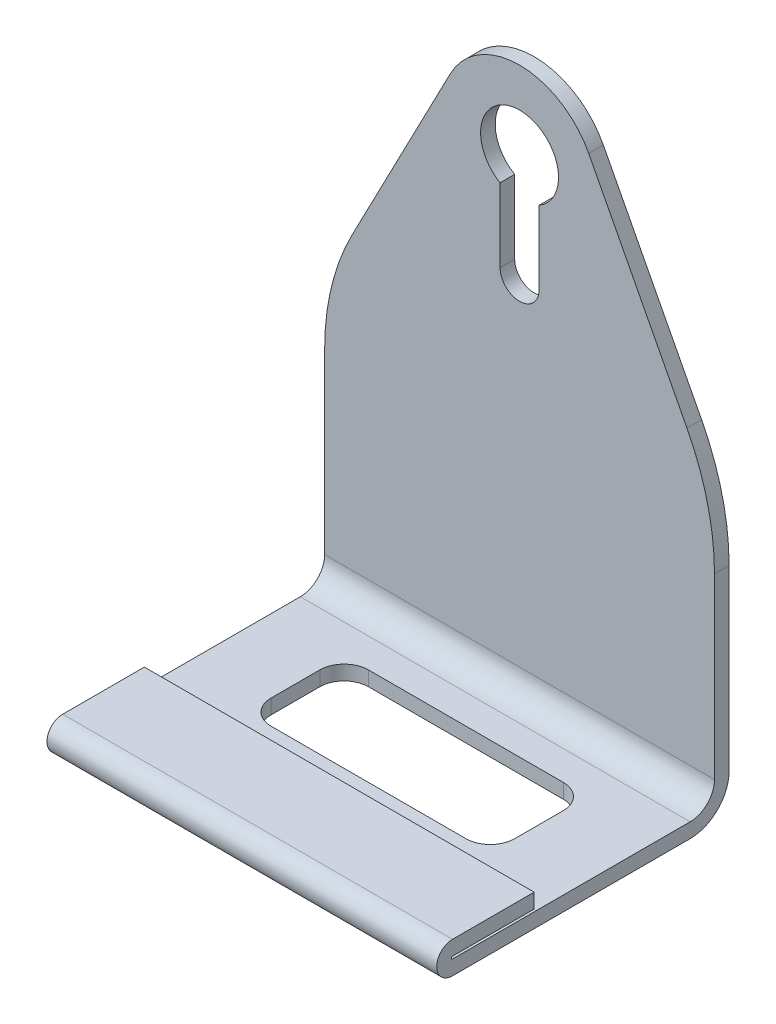
ISO-10303-21;
HEADER;
FILE_DESCRIPTION(('STEP AP214'),'2;1');
FILE_NAME('part.step','',(''),(''),'','','');
FILE_SCHEMA(('AUTOMOTIVE_DESIGN { 1 0 10303 214 1 1 1 1 }'));
ENDSEC;
DATA;
#1=APPLICATION_CONTEXT('core data for automotive mechanical design processes');
#2=APPLICATION_PROTOCOL_DEFINITION('international standard','automotive_design',2000,#1);
#3=PRODUCT_CONTEXT('',#1,'mechanical');
#4=PRODUCT('Part','Part','',(#3));
#5=PRODUCT_RELATED_PRODUCT_CATEGORY('part','',(#4));
#6=PRODUCT_DEFINITION_FORMATION('','',#4);
#7=PRODUCT_DEFINITION_CONTEXT('part definition',#1,'design');
#8=PRODUCT_DEFINITION('design','',#6,#7);
#9=PRODUCT_DEFINITION_SHAPE('','',#8);
#10=(LENGTH_UNIT() NAMED_UNIT(*) SI_UNIT(.MILLI.,.METRE.));
#11=(NAMED_UNIT(*) PLANE_ANGLE_UNIT() SI_UNIT($,.RADIAN.));
#12=(NAMED_UNIT(*) SI_UNIT($,.STERADIAN.) SOLID_ANGLE_UNIT());
#13=UNCERTAINTY_MEASURE_WITH_UNIT(LENGTH_MEASURE(1.E-05),#10,'distance_accuracy_value','');
#14=(GEOMETRIC_REPRESENTATION_CONTEXT(3) GLOBAL_UNCERTAINTY_ASSIGNED_CONTEXT((#13)) GLOBAL_UNIT_ASSIGNED_CONTEXT((#10,
#11,#12)) REPRESENTATION_CONTEXT('',''));
#15=CARTESIAN_POINT('',(0.,0.,0.));
#16=DIRECTION('',(0.,0.,1.));
#17=DIRECTION('',(1.,0.,0.));
#18=AXIS2_PLACEMENT_3D('',#15,#16,#17);
#19=CARTESIAN_POINT('',(40.,115.,3.));
#20=DIRECTION('',(0.,0.,-1.));
#21=DIRECTION('',(0.,1.,0.));
#22=AXIS2_PLACEMENT_3D('',#19,#20,#21);
#23=PLANE('',#22);
#24=DIRECTION('',(0.,1.,0.));
#25=VECTOR('',#24,1.);
#26=CARTESIAN_POINT('',(-4.,115.,3.));
#27=LINE('',#26,#25);
#28=CARTESIAN_POINT('',(-4.,77.,3.));
#29=VERTEX_POINT('',#28);
#30=CARTESIAN_POINT('',(-4.,92.0717967697245,3.));
#31=VERTEX_POINT('',#30);
#32=EDGE_CURVE('E316',#29,#31,#27,.T.);
#33=ORIENTED_EDGE('',*,*,#32,.T.);
#34=CARTESIAN_POINT('',(0.,99.,3.));
#35=DIRECTION('',(0.,0.,-1.));
#36=DIRECTION('',(0.,1.,0.));
#37=AXIS2_PLACEMENT_3D('',#34,#35,#36);
#38=CIRCLE('',#37,8.);
#39=CARTESIAN_POINT('',(4.,92.0717967697245,3.));
#40=VERTEX_POINT('',#39);
#41=EDGE_CURVE('E331',#31,#40,#38,.T.);
#42=ORIENTED_EDGE('',*,*,#41,.T.);
#43=DIRECTION('',(0.,1.,0.));
#44=VECTOR('',#43,1.);
#45=CARTESIAN_POINT('',(4.,115.,3.));
#46=LINE('',#45,#44);
#47=CARTESIAN_POINT('',(4.,77.,3.));
#48=VERTEX_POINT('',#47);
#49=EDGE_CURVE('E329',#48,#40,#46,.T.);
#50=ORIENTED_EDGE('',*,*,#49,.F.);
#51=CARTESIAN_POINT('',(0.,77.,2.99999999999999));
#52=DIRECTION('',(0.,0.,-1.));
#53=DIRECTION('',(0.,1.,0.));
#54=AXIS2_PLACEMENT_3D('',#51,#52,#53);
#55=CIRCLE('',#54,4.);
#56=EDGE_CURVE('E326',#48,#29,#55,.T.);
#57=ORIENTED_EDGE('',*,*,#56,.T.);
#58=EDGE_LOOP('',(#33,#42,#50,#57));
#59=FACE_BOUND('',#58,.T.);
#60=DIRECTION('',(0.,-1.,0.));
#61=VECTOR('',#60,1.);
#62=CARTESIAN_POINT('',(40.,115.,3.));
#63=LINE('',#62,#61);
#64=CARTESIAN_POINT('',(40.,44.5766818829046,2.99999999999999));
#65=VERTEX_POINT('',#64);
#66=CARTESIAN_POINT('',(40.,8.00000000000004,2.99999999999999));
#67=VERTEX_POINT('',#66);
#68=EDGE_CURVE('E353',#65,#67,#63,.T.);
#69=ORIENTED_EDGE('',*,*,#68,.F.);
#70=CARTESIAN_POINT('',(-10.,44.5766818829046,3.));
#71=DIRECTION('',(0.,0.,-1.));
#72=DIRECTION('',(0.,1.,0.));
#73=AXIS2_PLACEMENT_3D('',#70,#71,#72);
#74=CIRCLE('',#73,50.);
#75=CARTESIAN_POINT('',(34.3505416589112,67.6641125446562,2.99999999999999));
#76=VERTEX_POINT('',#75);
#77=EDGE_CURVE('E441',#65,#76,#74,.F.);
#78=ORIENTED_EDGE('',*,*,#77,.T.);
#79=DIRECTION('',(0.461748613235032,-0.887010833178223,0.));
#80=VECTOR('',#79,1.);
#81=CARTESIAN_POINT('',(16.1674282495186,102.593548416789,3.));
#82=LINE('',#81,#80);
#83=CARTESIAN_POINT('',(14.1921733308516,106.387977811761,3.));
#84=VERTEX_POINT('',#83);
#85=EDGE_CURVE('E347',#84,#76,#82,.T.);
#86=ORIENTED_EDGE('',*,*,#85,.F.);
#87=CARTESIAN_POINT('',(0.,99.,3.));
#88=DIRECTION('',(0.,0.,-1.));
#89=DIRECTION('',(0.,1.,0.));
#90=AXIS2_PLACEMENT_3D('',#87,#88,#89);
#91=CIRCLE('',#90,16.);
#92=CARTESIAN_POINT('',(-14.1921733308516,106.387977811761,3.));
#93=VERTEX_POINT('',#92);
#94=EDGE_CURVE('E350',#93,#84,#91,.T.);
#95=ORIENTED_EDGE('',*,*,#94,.F.);
#96=DIRECTION('',(0.461748613235032,0.887010833178223,0.));
#97=VECTOR('',#96,1.);
#98=CARTESIAN_POINT('',(0.88951429643936,135.359630188349,3.));
#99=LINE('',#98,#97);
#100=CARTESIAN_POINT('',(-34.3505416589111,67.6641125446562,2.99999999999999));
#101=VERTEX_POINT('',#100);
#102=EDGE_CURVE('E343',#101,#93,#99,.T.);
#103=ORIENTED_EDGE('',*,*,#102,.F.);
#104=CARTESIAN_POINT('',(10.,44.5766818829046,2.99999999999999));
#105=DIRECTION('',(0.,0.,-1.));
#106=DIRECTION('',(0.,1.,0.));
#107=AXIS2_PLACEMENT_3D('',#104,#105,#106);
#108=CIRCLE('',#107,50.);
#109=CARTESIAN_POINT('',(-40.,44.5766818829046,2.99999999999999));
#110=VERTEX_POINT('',#109);
#111=EDGE_CURVE('E439',#101,#110,#108,.F.);
#112=ORIENTED_EDGE('',*,*,#111,.T.);
#113=DIRECTION('',(0.,-1.,0.));
#114=VECTOR('',#113,1.);
#115=CARTESIAN_POINT('',(-40.,115.,3.));
#116=LINE('',#115,#114);
#117=CARTESIAN_POINT('',(-40.,8.00000000000004,2.99999999999999));
#118=VERTEX_POINT('',#117);
#119=EDGE_CURVE('E352',#110,#118,#116,.T.);
#120=ORIENTED_EDGE('',*,*,#119,.T.);
#121=DIRECTION('',(-1.,0.,0.));
#122=VECTOR('',#121,1.);
#123=CARTESIAN_POINT('',(40.,8.00000000000004,2.99999999999999));
#124=LINE('',#123,#122);
#125=EDGE_CURVE('E425',#67,#118,#124,.T.);
#126=ORIENTED_EDGE('',*,*,#125,.F.);
#127=EDGE_LOOP('',(#69,#78,#86,#95,#103,#112,#120,#126));
#128=FACE_BOUND('',#127,.T.);
#129=ADVANCED_FACE('F43',(#59,#128),#23,.F.);
#130=CARTESIAN_POINT('',(40.,8.00000000000006,0.));
#131=DIRECTION('',(0.,0.,1.));
#132=DIRECTION('',(1.,0.,0.));
#133=AXIS2_PLACEMENT_3D('',#130,#131,#132);
#134=PLANE('',#133);
#135=DIRECTION('',(0.,-1.,0.));
#136=VECTOR('',#135,1.);
#137=CARTESIAN_POINT('',(4.,0.,0.));
#138=LINE('',#137,#136);
#139=CARTESIAN_POINT('',(4.,92.0717967697245,0.));
#140=VERTEX_POINT('',#139);
#141=CARTESIAN_POINT('',(4.,77.,0.));
#142=VERTEX_POINT('',#141);
#143=EDGE_CURVE('E310',#140,#142,#138,.T.);
#144=ORIENTED_EDGE('',*,*,#143,.F.);
#145=CARTESIAN_POINT('',(0.,99.,0.));
#146=DIRECTION('',(0.,0.,1.));
#147=DIRECTION('',(1.,0.,0.));
#148=AXIS2_PLACEMENT_3D('',#145,#146,#147);
#149=CIRCLE('',#148,8.);
#150=CARTESIAN_POINT('',(-4.,92.0717967697245,0.));
#151=VERTEX_POINT('',#150);
#152=EDGE_CURVE('E301',#140,#151,#149,.T.);
#153=ORIENTED_EDGE('',*,*,#152,.T.);
#154=DIRECTION('',(0.,-1.,0.));
#155=VECTOR('',#154,1.);
#156=CARTESIAN_POINT('',(-4.,0.,0.));
#157=LINE('',#156,#155);
#158=CARTESIAN_POINT('',(-4.,77.,0.));
#159=VERTEX_POINT('',#158);
#160=EDGE_CURVE('E304',#151,#159,#157,.T.);
#161=ORIENTED_EDGE('',*,*,#160,.T.);
#162=CARTESIAN_POINT('',(0.,77.,0.));
#163=DIRECTION('',(0.,0.,1.));
#164=DIRECTION('',(1.,0.,0.));
#165=AXIS2_PLACEMENT_3D('',#162,#163,#164);
#166=CIRCLE('',#165,4.);
#167=EDGE_CURVE('E307',#159,#142,#166,.T.);
#168=ORIENTED_EDGE('',*,*,#167,.T.);
#169=EDGE_LOOP('',(#144,#153,#161,#168));
#170=FACE_BOUND('',#169,.T.);
#171=DIRECTION('',(-0.461748613235032,0.887010833178223,0.));
#172=VECTOR('',#171,1.);
#173=CARTESIAN_POINT('',(59.9920626189795,18.407209072008,0.));
#174=LINE('',#173,#172);
#175=CARTESIAN_POINT('',(34.3505416589111,67.6641125446562,0.));
#176=VERTEX_POINT('',#175);
#177=CARTESIAN_POINT('',(14.1921733308516,106.387977811761,0.));
#178=VERTEX_POINT('',#177);
#179=EDGE_CURVE('E345',#176,#178,#174,.T.);
#180=ORIENTED_EDGE('',*,*,#179,.F.);
#181=CARTESIAN_POINT('',(-10.,44.5766818829046,0.));
#182=DIRECTION('',(0.,0.,1.));
#183=DIRECTION('',(1.,0.,0.));
#184=AXIS2_PLACEMENT_3D('',#181,#182,#183);
#185=CIRCLE('',#184,50.);
#186=CARTESIAN_POINT('',(40.,44.5766818829046,0.));
#187=VERTEX_POINT('',#186);
#188=EDGE_CURVE('E435',#176,#187,#185,.F.);
#189=ORIENTED_EDGE('',*,*,#188,.T.);
#190=DIRECTION('',(0.,1.,0.));
#191=VECTOR('',#190,1.);
#192=CARTESIAN_POINT('',(40.,8.00000000000006,0.));
#193=LINE('',#192,#191);
#194=CARTESIAN_POINT('',(40.,8.00000000000006,0.));
#195=VERTEX_POINT('',#194);
#196=EDGE_CURVE('E374',#195,#187,#193,.T.);
#197=ORIENTED_EDGE('',*,*,#196,.F.);
#198=DIRECTION('',(-1.,0.,0.));
#199=VECTOR('',#198,1.);
#200=CARTESIAN_POINT('',(40.,8.00000000000006,0.));
#201=LINE('',#200,#199);
#202=CARTESIAN_POINT('',(-40.,8.00000000000006,0.));
#203=VERTEX_POINT('',#202);
#204=EDGE_CURVE('E377',#195,#203,#201,.T.);
#205=ORIENTED_EDGE('',*,*,#204,.T.);
#206=DIRECTION('',(0.,1.,0.));
#207=VECTOR('',#206,1.);
#208=CARTESIAN_POINT('',(-40.,8.00000000000006,0.));
#209=LINE('',#208,#207);
#210=CARTESIAN_POINT('',(-40.,44.5766818829046,0.));
#211=VERTEX_POINT('',#210);
#212=EDGE_CURVE('E356',#203,#211,#209,.T.);
#213=ORIENTED_EDGE('',*,*,#212,.T.);
#214=CARTESIAN_POINT('',(10.,44.5766818829046,0.));
#215=DIRECTION('',(0.,0.,1.));
#216=DIRECTION('',(1.,0.,0.));
#217=AXIS2_PLACEMENT_3D('',#214,#215,#216);
#218=CIRCLE('',#217,50.);
#219=CARTESIAN_POINT('',(-34.3505416589111,67.6641125446562,0.));
#220=VERTEX_POINT('',#219);
#221=EDGE_CURVE('E433',#211,#220,#218,.F.);
#222=ORIENTED_EDGE('',*,*,#221,.T.);
#223=DIRECTION('',(-0.461748613235032,-0.887010833178223,0.));
#224=VECTOR('',#223,1.);
#225=CARTESIAN_POINT('',(-42.9351200730215,51.1732908435676,0.));
#226=LINE('',#225,#224);
#227=CARTESIAN_POINT('',(-14.1921733308516,106.387977811761,0.));
#228=VERTEX_POINT('',#227);
#229=EDGE_CURVE('E340',#228,#220,#226,.T.);
#230=ORIENTED_EDGE('',*,*,#229,.F.);
#231=CARTESIAN_POINT('',(0.,99.,0.));
#232=DIRECTION('',(0.,0.,1.));
#233=DIRECTION('',(1.,0.,0.));
#234=AXIS2_PLACEMENT_3D('',#231,#232,#233);
#235=CIRCLE('',#234,16.);
#236=EDGE_CURVE('E428',#178,#228,#235,.T.);
#237=ORIENTED_EDGE('',*,*,#236,.F.);
#238=EDGE_LOOP('',(#180,#189,#197,#205,#213,#222,#230,#237));
#239=FACE_BOUND('',#238,.T.);
#240=ADVANCED_FACE('F454',(#170,#239),#134,.F.);
#241=CARTESIAN_POINT('',(40.,8.,7.99999999999999));
#242=DIRECTION('',(-1.,0.,0.));
#243=DIRECTION('',(0.,0.,1.));
#244=AXIS2_PLACEMENT_3D('',#241,#242,#243);
#245=PLANE('',#244);
#246=ORIENTED_EDGE('',*,*,#196,.T.);
#247=DIRECTION('',(0.,0.,-1.));
#248=VECTOR('',#247,1.);
#249=CARTESIAN_POINT('',(40.,44.5766818829046,3.));
#250=LINE('',#249,#248);
#251=EDGE_CURVE('E437',#187,#65,#250,.F.);
#252=ORIENTED_EDGE('',*,*,#251,.T.);
#253=ORIENTED_EDGE('',*,*,#68,.T.);
#254=CARTESIAN_POINT('',(40.,8.,7.99999999999999));
#255=DIRECTION('',(-1.,0.,0.));
#256=DIRECTION('',(0.,0.,1.));
#257=AXIS2_PLACEMENT_3D('',#254,#255,#256);
#258=CIRCLE('',#257,5.);
#259=CARTESIAN_POINT('',(40.,3.,8.00000000000002));
#260=VERTEX_POINT('',#259);
#261=EDGE_CURVE('E355',#67,#260,#258,.T.);
#262=ORIENTED_EDGE('',*,*,#261,.T.);
#263=DIRECTION('',(0.,0.,1.));
#264=VECTOR('',#263,1.);
#265=CARTESIAN_POINT('',(40.,3.,8.00000000000002));
#266=LINE('',#265,#264);
#267=CARTESIAN_POINT('',(40.,3.,56.75));
#268=VERTEX_POINT('',#267);
#269=EDGE_CURVE('E358',#260,#268,#266,.T.);
#270=ORIENTED_EDGE('',*,*,#269,.T.);
#271=CARTESIAN_POINT('',(40.,3.25,56.75));
#272=DIRECTION('',(-1.,0.,0.));
#273=DIRECTION('',(0.,0.,1.));
#274=AXIS2_PLACEMENT_3D('',#271,#272,#273);
#275=CIRCLE('',#274,0.25);
#276=CARTESIAN_POINT('',(40.,3.5,56.75));
#277=VERTEX_POINT('',#276);
#278=EDGE_CURVE('E360',#268,#277,#275,.T.);
#279=ORIENTED_EDGE('',*,*,#278,.T.);
#280=DIRECTION('',(0.,0.,-1.));
#281=VECTOR('',#280,1.);
#282=CARTESIAN_POINT('',(40.,3.5,56.75));
#283=LINE('',#282,#281);
#284=CARTESIAN_POINT('',(40.,3.5,40.));
#285=VERTEX_POINT('',#284);
#286=EDGE_CURVE('E362',#277,#285,#283,.T.);
#287=ORIENTED_EDGE('',*,*,#286,.T.);
#288=DIRECTION('',(0.,1.,0.));
#289=VECTOR('',#288,1.);
#290=CARTESIAN_POINT('',(40.,3.5,40.));
#291=LINE('',#290,#289);
#292=CARTESIAN_POINT('',(40.,6.5,40.));
#293=VERTEX_POINT('',#292);
#294=EDGE_CURVE('E364',#285,#293,#291,.T.);
#295=ORIENTED_EDGE('',*,*,#294,.T.);
#296=DIRECTION('',(0.,0.,1.));
#297=VECTOR('',#296,1.);
#298=CARTESIAN_POINT('',(40.,6.5,40.));
#299=LINE('',#298,#297);
#300=CARTESIAN_POINT('',(40.,6.5,56.75));
#301=VERTEX_POINT('',#300);
#302=EDGE_CURVE('E366',#293,#301,#299,.T.);
#303=ORIENTED_EDGE('',*,*,#302,.T.);
#304=CARTESIAN_POINT('',(40.,3.25,56.75));
#305=DIRECTION('',(1.,0.,0.));
#306=DIRECTION('',(0.,0.,-1.));
#307=AXIS2_PLACEMENT_3D('',#304,#305,#306);
#308=CIRCLE('',#307,3.25);
#309=CARTESIAN_POINT('',(40.,0.,56.75));
#310=VERTEX_POINT('',#309);
#311=EDGE_CURVE('E368',#301,#310,#308,.T.);
#312=ORIENTED_EDGE('',*,*,#311,.T.);
#313=DIRECTION('',(0.,0.,-1.));
#314=VECTOR('',#313,1.);
#315=CARTESIAN_POINT('',(40.,0.,56.75));
#316=LINE('',#315,#314);
#317=CARTESIAN_POINT('',(40.,0.,8.00000000000005));
#318=VERTEX_POINT('',#317);
#319=EDGE_CURVE('E370',#310,#318,#316,.T.);
#320=ORIENTED_EDGE('',*,*,#319,.T.);
#321=CARTESIAN_POINT('',(40.,8.,8.));
#322=DIRECTION('',(1.,0.,0.));
#323=DIRECTION('',(0.,0.,1.));
#324=AXIS2_PLACEMENT_3D('',#321,#322,#323);
#325=CIRCLE('',#324,8.);
#326=EDGE_CURVE('E372',#318,#195,#325,.T.);
#327=ORIENTED_EDGE('',*,*,#326,.T.);
#328=EDGE_LOOP('',(#246,#252,#253,#262,#270,#279,#287,#295,#303,#312,#320,#327));
#329=FACE_BOUND('',#328,.T.);
#330=ADVANCED_FACE('F520',(#329),#245,.F.);
#331=CARTESIAN_POINT('',(-40.,8.,7.99999999999999));
#332=DIRECTION('',(-1.,0.,0.));
#333=DIRECTION('',(0.,0.,1.));
#334=AXIS2_PLACEMENT_3D('',#331,#332,#333);
#335=PLANE('',#334);
#336=ORIENTED_EDGE('',*,*,#119,.F.);
#337=DIRECTION('',(0.,0.,-1.));
#338=VECTOR('',#337,1.);
#339=CARTESIAN_POINT('',(-40.,44.5766818829046,7.99999999999999));
#340=LINE('',#339,#338);
#341=EDGE_CURVE('E51',#110,#211,#340,.T.);
#342=ORIENTED_EDGE('',*,*,#341,.T.);
#343=ORIENTED_EDGE('',*,*,#212,.F.);
#344=CARTESIAN_POINT('',(-40.,8.,8.));
#345=DIRECTION('',(1.,0.,0.));
#346=DIRECTION('',(0.,0.,1.));
#347=AXIS2_PLACEMENT_3D('',#344,#345,#346);
#348=CIRCLE('',#347,8.);
#349=CARTESIAN_POINT('',(-40.,0.,8.00000000000005));
#350=VERTEX_POINT('',#349);
#351=EDGE_CURVE('E395',#350,#203,#348,.T.);
#352=ORIENTED_EDGE('',*,*,#351,.F.);
#353=DIRECTION('',(0.,0.,-1.));
#354=VECTOR('',#353,1.);
#355=CARTESIAN_POINT('',(-40.,0.,56.75));
#356=LINE('',#355,#354);
#357=CARTESIAN_POINT('',(-40.,0.,56.75));
#358=VERTEX_POINT('',#357);
#359=EDGE_CURVE('E393',#358,#350,#356,.T.);
#360=ORIENTED_EDGE('',*,*,#359,.F.);
#361=CARTESIAN_POINT('',(-40.,3.25,56.75));
#362=DIRECTION('',(1.,0.,0.));
#363=DIRECTION('',(0.,0.,-1.));
#364=AXIS2_PLACEMENT_3D('',#361,#362,#363);
#365=CIRCLE('',#364,3.25);
#366=CARTESIAN_POINT('',(-40.,6.5,56.75));
#367=VERTEX_POINT('',#366);
#368=EDGE_CURVE('E391',#367,#358,#365,.T.);
#369=ORIENTED_EDGE('',*,*,#368,.F.);
#370=DIRECTION('',(0.,0.,1.));
#371=VECTOR('',#370,1.);
#372=CARTESIAN_POINT('',(-40.,6.5,40.));
#373=LINE('',#372,#371);
#374=CARTESIAN_POINT('',(-40.,6.5,40.));
#375=VERTEX_POINT('',#374);
#376=EDGE_CURVE('E389',#375,#367,#373,.T.);
#377=ORIENTED_EDGE('',*,*,#376,.F.);
#378=DIRECTION('',(0.,1.,0.));
#379=VECTOR('',#378,1.);
#380=CARTESIAN_POINT('',(-40.,3.5,40.));
#381=LINE('',#380,#379);
#382=CARTESIAN_POINT('',(-40.,3.5,40.));
#383=VERTEX_POINT('',#382);
#384=EDGE_CURVE('E387',#383,#375,#381,.T.);
#385=ORIENTED_EDGE('',*,*,#384,.F.);
#386=DIRECTION('',(0.,0.,-1.));
#387=VECTOR('',#386,1.);
#388=CARTESIAN_POINT('',(-40.,3.5,56.75));
#389=LINE('',#388,#387);
#390=CARTESIAN_POINT('',(-40.,3.5,56.75));
#391=VERTEX_POINT('',#390);
#392=EDGE_CURVE('E385',#391,#383,#389,.T.);
#393=ORIENTED_EDGE('',*,*,#392,.F.);
#394=CARTESIAN_POINT('',(-40.,3.25,56.75));
#395=DIRECTION('',(-1.,0.,0.));
#396=DIRECTION('',(0.,0.,1.));
#397=AXIS2_PLACEMENT_3D('',#394,#395,#396);
#398=CIRCLE('',#397,0.25);
#399=CARTESIAN_POINT('',(-40.,3.,56.75));
#400=VERTEX_POINT('',#399);
#401=EDGE_CURVE('E383',#400,#391,#398,.T.);
#402=ORIENTED_EDGE('',*,*,#401,.F.);
#403=DIRECTION('',(0.,0.,1.));
#404=VECTOR('',#403,1.);
#405=CARTESIAN_POINT('',(-40.,3.,8.00000000000002));
#406=LINE('',#405,#404);
#407=CARTESIAN_POINT('',(-40.,3.,8.00000000000002));
#408=VERTEX_POINT('',#407);
#409=EDGE_CURVE('E381',#408,#400,#406,.T.);
#410=ORIENTED_EDGE('',*,*,#409,.F.);
#411=CARTESIAN_POINT('',(-40.,8.,7.99999999999999));
#412=DIRECTION('',(-1.,0.,0.));
#413=DIRECTION('',(0.,0.,1.));
#414=AXIS2_PLACEMENT_3D('',#411,#412,#413);
#415=CIRCLE('',#414,5.);
#416=EDGE_CURVE('E379',#118,#408,#415,.T.);
#417=ORIENTED_EDGE('',*,*,#416,.F.);
#418=EDGE_LOOP('',(#336,#342,#343,#352,#360,#369,#377,#385,#393,#402,#410,#417));
#419=FACE_BOUND('',#418,.T.);
#420=ADVANCED_FACE('F447',(#419),#335,.T.);
#421=CARTESIAN_POINT('',(40.,8.,7.99999999999999));
#422=DIRECTION('',(-1.,0.,0.));
#423=DIRECTION('',(0.,0.,1.));
#424=AXIS2_PLACEMENT_3D('',#421,#422,#423);
#425=CYLINDRICAL_SURFACE('',#424,5.);
#426=ORIENTED_EDGE('',*,*,#416,.T.);
#427=DIRECTION('',(-1.,0.,0.));
#428=VECTOR('',#427,1.);
#429=CARTESIAN_POINT('',(40.,3.,8.00000000000002));
#430=LINE('',#429,#428);
#431=EDGE_CURVE('E422',#260,#408,#430,.T.);
#432=ORIENTED_EDGE('',*,*,#431,.F.);
#433=ORIENTED_EDGE('',*,*,#261,.F.);
#434=ORIENTED_EDGE('',*,*,#125,.T.);
#435=EDGE_LOOP('',(#426,#432,#433,#434));
#436=FACE_BOUND('',#435,.T.);
#437=ADVANCED_FACE('F497',(#436),#425,.F.);
#438=CARTESIAN_POINT('',(40.,3.,8.00000000000002));
#439=DIRECTION('',(0.,-1.,0.));
#440=DIRECTION('',(0.,0.,-1.));
#441=AXIS2_PLACEMENT_3D('',#438,#439,#440);
#442=PLANE('',#441);
#443=DIRECTION('',(1.,0.,0.));
#444=VECTOR('',#443,1.);
#445=CARTESIAN_POINT('',(40.,3.,14.));
#446=LINE('',#445,#444);
#447=CARTESIAN_POINT('',(-20.,3.,14.));
#448=VERTEX_POINT('',#447);
#449=CARTESIAN_POINT('',(20.,3.,14.));
#450=VERTEX_POINT('',#449);
#451=EDGE_CURVE('E264',#448,#450,#446,.T.);
#452=ORIENTED_EDGE('',*,*,#451,.T.);
#453=CARTESIAN_POINT('',(20.,3.,19.));
#454=DIRECTION('',(0.,-1.,0.));
#455=DIRECTION('',(0.,0.,-1.));
#456=AXIS2_PLACEMENT_3D('',#453,#454,#455);
#457=CIRCLE('',#456,5.);
#458=CARTESIAN_POINT('',(25.,3.,19.));
#459=VERTEX_POINT('',#458);
#460=EDGE_CURVE('E233',#450,#459,#457,.T.);
#461=ORIENTED_EDGE('',*,*,#460,.T.);
#462=DIRECTION('',(0.,0.,1.));
#463=VECTOR('',#462,1.);
#464=CARTESIAN_POINT('',(25.,3.,8.00000000000002));
#465=LINE('',#464,#463);
#466=CARTESIAN_POINT('',(25.,3.,29.));
#467=VERTEX_POINT('',#466);
#468=EDGE_CURVE('E297',#459,#467,#465,.T.);
#469=ORIENTED_EDGE('',*,*,#468,.T.);
#470=CARTESIAN_POINT('',(20.,3.,29.));
#471=DIRECTION('',(0.,-1.,0.));
#472=DIRECTION('',(0.,0.,-1.));
#473=AXIS2_PLACEMENT_3D('',#470,#471,#472);
#474=CIRCLE('',#473,5.);
#475=CARTESIAN_POINT('',(20.,3.,34.));
#476=VERTEX_POINT('',#475);
#477=EDGE_CURVE('E294',#467,#476,#474,.T.);
#478=ORIENTED_EDGE('',*,*,#477,.T.);
#479=DIRECTION('',(-1.,0.,0.));
#480=VECTOR('',#479,1.);
#481=CARTESIAN_POINT('',(40.,3.,34.));
#482=LINE('',#481,#480);
#483=CARTESIAN_POINT('',(-20.,3.,34.));
#484=VERTEX_POINT('',#483);
#485=EDGE_CURVE('E291',#476,#484,#482,.T.);
#486=ORIENTED_EDGE('',*,*,#485,.T.);
#487=CARTESIAN_POINT('',(-20.,3.,29.));
#488=DIRECTION('',(0.,-1.,0.));
#489=DIRECTION('',(0.,0.,-1.));
#490=AXIS2_PLACEMENT_3D('',#487,#488,#489);
#491=CIRCLE('',#490,5.);
#492=CARTESIAN_POINT('',(-25.,3.,29.));
#493=VERTEX_POINT('',#492);
#494=EDGE_CURVE('E288',#484,#493,#491,.T.);
#495=ORIENTED_EDGE('',*,*,#494,.T.);
#496=DIRECTION('',(0.,0.,-1.));
#497=VECTOR('',#496,1.);
#498=CARTESIAN_POINT('',(-25.,3.,8.));
#499=LINE('',#498,#497);
#500=CARTESIAN_POINT('',(-25.,3.,19.));
#501=VERTEX_POINT('',#500);
#502=EDGE_CURVE('E285',#493,#501,#499,.T.);
#503=ORIENTED_EDGE('',*,*,#502,.T.);
#504=CARTESIAN_POINT('',(-20.,3.,19.));
#505=DIRECTION('',(0.,-1.,0.));
#506=DIRECTION('',(0.,0.,-1.));
#507=AXIS2_PLACEMENT_3D('',#504,#505,#506);
#508=CIRCLE('',#507,5.);
#509=EDGE_CURVE('E282',#501,#448,#508,.T.);
#510=ORIENTED_EDGE('',*,*,#509,.T.);
#511=EDGE_LOOP('',(#452,#461,#469,#478,#486,#495,#503,#510));
#512=FACE_BOUND('',#511,.T.);
#513=ORIENTED_EDGE('',*,*,#409,.T.);
#514=DIRECTION('',(-1.,0.,0.));
#515=VECTOR('',#514,1.);
#516=CARTESIAN_POINT('',(40.,3.,56.75));
#517=LINE('',#516,#515);
#518=EDGE_CURVE('E419',#268,#400,#517,.T.);
#519=ORIENTED_EDGE('',*,*,#518,.F.);
#520=ORIENTED_EDGE('',*,*,#269,.F.);
#521=ORIENTED_EDGE('',*,*,#431,.T.);
#522=EDGE_LOOP('',(#513,#519,#520,#521));
#523=FACE_BOUND('',#522,.T.);
#524=ADVANCED_FACE('F492',(#512,#523),#442,.F.);
#525=CARTESIAN_POINT('',(40.,3.25,56.75));
#526=DIRECTION('',(-1.,0.,0.));
#527=DIRECTION('',(0.,0.,1.));
#528=AXIS2_PLACEMENT_3D('',#525,#526,#527);
#529=CYLINDRICAL_SURFACE('',#528,0.25);
#530=ORIENTED_EDGE('',*,*,#401,.T.);
#531=DIRECTION('',(-1.,0.,0.));
#532=VECTOR('',#531,1.);
#533=CARTESIAN_POINT('',(40.,3.5,56.75));
#534=LINE('',#533,#532);
#535=EDGE_CURVE('E416',#277,#391,#534,.T.);
#536=ORIENTED_EDGE('',*,*,#535,.F.);
#537=ORIENTED_EDGE('',*,*,#278,.F.);
#538=ORIENTED_EDGE('',*,*,#518,.T.);
#539=EDGE_LOOP('',(#530,#536,#537,#538));
#540=FACE_BOUND('',#539,.T.);
#541=ADVANCED_FACE('F488',(#540),#529,.F.);
#542=CARTESIAN_POINT('',(40.,3.5,56.75));
#543=DIRECTION('',(0.,1.,0.));
#544=DIRECTION('',(0.,0.,1.));
#545=AXIS2_PLACEMENT_3D('',#542,#543,#544);
#546=PLANE('',#545);
#547=ORIENTED_EDGE('',*,*,#392,.T.);
#548=DIRECTION('',(-1.,0.,0.));
#549=VECTOR('',#548,1.);
#550=CARTESIAN_POINT('',(40.,3.5,40.));
#551=LINE('',#550,#549);
#552=EDGE_CURVE('E413',#285,#383,#551,.T.);
#553=ORIENTED_EDGE('',*,*,#552,.F.);
#554=ORIENTED_EDGE('',*,*,#286,.F.);
#555=ORIENTED_EDGE('',*,*,#535,.T.);
#556=EDGE_LOOP('',(#547,#553,#554,#555));
#557=FACE_BOUND('',#556,.T.);
#558=ADVANCED_FACE('F484',(#557),#546,.F.);
#559=CARTESIAN_POINT('',(40.,3.5,40.));
#560=DIRECTION('',(0.,0.,1.));
#561=DIRECTION('',(1.,0.,0.));
#562=AXIS2_PLACEMENT_3D('',#559,#560,#561);
#563=PLANE('',#562);
#564=ORIENTED_EDGE('',*,*,#384,.T.);
#565=DIRECTION('',(-1.,0.,0.));
#566=VECTOR('',#565,1.);
#567=CARTESIAN_POINT('',(40.,6.5,40.));
#568=LINE('',#567,#566);
#569=EDGE_CURVE('E410',#293,#375,#568,.T.);
#570=ORIENTED_EDGE('',*,*,#569,.F.);
#571=ORIENTED_EDGE('',*,*,#294,.F.);
#572=ORIENTED_EDGE('',*,*,#552,.T.);
#573=EDGE_LOOP('',(#564,#570,#571,#572));
#574=FACE_BOUND('',#573,.T.);
#575=ADVANCED_FACE('F479',(#574),#563,.F.);
#576=CARTESIAN_POINT('',(40.,6.5,40.));
#577=DIRECTION('',(0.,-1.,0.));
#578=DIRECTION('',(0.,0.,-1.));
#579=AXIS2_PLACEMENT_3D('',#576,#577,#578);
#580=PLANE('',#579);
#581=ORIENTED_EDGE('',*,*,#376,.T.);
#582=DIRECTION('',(-1.,0.,0.));
#583=VECTOR('',#582,1.);
#584=CARTESIAN_POINT('',(40.,6.5,56.75));
#585=LINE('',#584,#583);
#586=EDGE_CURVE('E407',#301,#367,#585,.T.);
#587=ORIENTED_EDGE('',*,*,#586,.F.);
#588=ORIENTED_EDGE('',*,*,#302,.F.);
#589=ORIENTED_EDGE('',*,*,#569,.T.);
#590=EDGE_LOOP('',(#581,#587,#588,#589));
#591=FACE_BOUND('',#590,.T.);
#592=ADVANCED_FACE('F473',(#591),#580,.F.);
#593=CARTESIAN_POINT('',(40.,3.25,56.75));
#594=DIRECTION('',(-1.,0.,0.));
#595=DIRECTION('',(0.,0.,1.));
#596=AXIS2_PLACEMENT_3D('',#593,#594,#595);
#597=CYLINDRICAL_SURFACE('',#596,3.25);
#598=ORIENTED_EDGE('',*,*,#368,.T.);
#599=DIRECTION('',(-1.,0.,0.));
#600=VECTOR('',#599,1.);
#601=CARTESIAN_POINT('',(40.,0.,56.75));
#602=LINE('',#601,#600);
#603=EDGE_CURVE('E404',#310,#358,#602,.T.);
#604=ORIENTED_EDGE('',*,*,#603,.F.);
#605=ORIENTED_EDGE('',*,*,#311,.F.);
#606=ORIENTED_EDGE('',*,*,#586,.T.);
#607=EDGE_LOOP('',(#598,#604,#605,#606));
#608=FACE_BOUND('',#607,.T.);
#609=ADVANCED_FACE('F469',(#608),#597,.T.);
#610=CARTESIAN_POINT('',(40.,0.,56.75));
#611=DIRECTION('',(0.,1.,0.));
#612=DIRECTION('',(0.,0.,1.));
#613=AXIS2_PLACEMENT_3D('',#610,#611,#612);
#614=PLANE('',#613);
#615=DIRECTION('',(0.,0.,-1.));
#616=VECTOR('',#615,1.);
#617=CARTESIAN_POINT('',(25.,0.,19.));
#618=LINE('',#617,#616);
#619=CARTESIAN_POINT('',(25.,0.,29.));
#620=VERTEX_POINT('',#619);
#621=CARTESIAN_POINT('',(25.,0.,19.));
#622=VERTEX_POINT('',#621);
#623=EDGE_CURVE('E236',#620,#622,#618,.T.);
#624=ORIENTED_EDGE('',*,*,#623,.T.);
#625=CARTESIAN_POINT('',(20.,0.,19.));
#626=DIRECTION('',(0.,1.,0.));
#627=DIRECTION('',(0.,0.,-1.));
#628=AXIS2_PLACEMENT_3D('',#625,#626,#627);
#629=CIRCLE('',#628,5.);
#630=CARTESIAN_POINT('',(20.,0.,14.));
#631=VERTEX_POINT('',#630);
#632=EDGE_CURVE('E230',#622,#631,#629,.T.);
#633=ORIENTED_EDGE('',*,*,#632,.T.);
#634=DIRECTION('',(-1.,0.,0.));
#635=VECTOR('',#634,1.);
#636=CARTESIAN_POINT('',(20.,0.,14.));
#637=LINE('',#636,#635);
#638=CARTESIAN_POINT('',(-20.,0.,14.));
#639=VERTEX_POINT('',#638);
#640=EDGE_CURVE('E239',#631,#639,#637,.T.);
#641=ORIENTED_EDGE('',*,*,#640,.T.);
#642=CARTESIAN_POINT('',(-20.,0.,19.));
#643=DIRECTION('',(0.,1.,0.));
#644=DIRECTION('',(0.,0.,1.));
#645=AXIS2_PLACEMENT_3D('',#642,#643,#644);
#646=CIRCLE('',#645,5.);
#647=CARTESIAN_POINT('',(-25.,0.,19.));
#648=VERTEX_POINT('',#647);
#649=EDGE_CURVE('E66',#639,#648,#646,.T.);
#650=ORIENTED_EDGE('',*,*,#649,.T.);
#651=DIRECTION('',(0.,0.,1.));
#652=VECTOR('',#651,1.);
#653=CARTESIAN_POINT('',(-25.,0.,19.));
#654=LINE('',#653,#652);
#655=CARTESIAN_POINT('',(-25.,0.,29.));
#656=VERTEX_POINT('',#655);
#657=EDGE_CURVE('E250',#648,#656,#654,.T.);
#658=ORIENTED_EDGE('',*,*,#657,.T.);
#659=CARTESIAN_POINT('',(-20.,0.,29.));
#660=DIRECTION('',(0.,1.,0.));
#661=DIRECTION('',(0.,0.,-1.));
#662=AXIS2_PLACEMENT_3D('',#659,#660,#661);
#663=CIRCLE('',#662,5.);
#664=CARTESIAN_POINT('',(-20.,0.,34.));
#665=VERTEX_POINT('',#664);
#666=EDGE_CURVE('E253',#656,#665,#663,.T.);
#667=ORIENTED_EDGE('',*,*,#666,.T.);
#668=DIRECTION('',(1.,0.,0.));
#669=VECTOR('',#668,1.);
#670=CARTESIAN_POINT('',(20.,0.,34.));
#671=LINE('',#670,#669);
#672=CARTESIAN_POINT('',(20.,0.,34.));
#673=VERTEX_POINT('',#672);
#674=EDGE_CURVE('E256',#665,#673,#671,.T.);
#675=ORIENTED_EDGE('',*,*,#674,.T.);
#676=CARTESIAN_POINT('',(20.,0.,29.));
#677=DIRECTION('',(0.,1.,0.));
#678=DIRECTION('',(0.,0.,-1.));
#679=AXIS2_PLACEMENT_3D('',#676,#677,#678);
#680=CIRCLE('',#679,5.);
#681=EDGE_CURVE('E259',#673,#620,#680,.T.);
#682=ORIENTED_EDGE('',*,*,#681,.T.);
#683=EDGE_LOOP('',(#624,#633,#641,#650,#658,#667,#675,#682));
#684=FACE_BOUND('',#683,.T.);
#685=ORIENTED_EDGE('',*,*,#359,.T.);
#686=DIRECTION('',(-1.,0.,0.));
#687=VECTOR('',#686,1.);
#688=CARTESIAN_POINT('',(40.,0.,8.00000000000005));
#689=LINE('',#688,#687);
#690=EDGE_CURVE('E401',#318,#350,#689,.T.);
#691=ORIENTED_EDGE('',*,*,#690,.F.);
#692=ORIENTED_EDGE('',*,*,#319,.F.);
#693=ORIENTED_EDGE('',*,*,#603,.T.);
#694=EDGE_LOOP('',(#685,#691,#692,#693));
#695=FACE_BOUND('',#694,.T.);
#696=ADVANCED_FACE('F243',(#684,#695),#614,.F.);
#697=CARTESIAN_POINT('',(40.,8.,8.));
#698=DIRECTION('',(-1.,0.,0.));
#699=DIRECTION('',(0.,0.,1.));
#700=AXIS2_PLACEMENT_3D('',#697,#698,#699);
#701=CYLINDRICAL_SURFACE('',#700,8.);
#702=ORIENTED_EDGE('',*,*,#351,.T.);
#703=ORIENTED_EDGE('',*,*,#204,.F.);
#704=ORIENTED_EDGE('',*,*,#326,.F.);
#705=ORIENTED_EDGE('',*,*,#690,.T.);
#706=EDGE_LOOP('',(#702,#703,#704,#705));
#707=FACE_BOUND('',#706,.T.);
#708=ADVANCED_FACE('F460',(#707),#701,.T.);
#709=CARTESIAN_POINT('',(0.,99.,193.496883176602));
#710=DIRECTION('',(0.,0.,-1.));
#711=DIRECTION('',(-1.,0.,0.));
#712=AXIS2_PLACEMENT_3D('',#709,#710,#711);
#713=CYLINDRICAL_SURFACE('',#712,16.);
#714=ORIENTED_EDGE('',*,*,#94,.T.);
#715=DIRECTION('',(0.,0.,-1.));
#716=VECTOR('',#715,1.);
#717=CARTESIAN_POINT('',(14.1921733308516,106.387977811761,193.496883176602));
#718=LINE('',#717,#716);
#719=EDGE_CURVE('E334',#84,#178,#718,.T.);
#720=ORIENTED_EDGE('',*,*,#719,.T.);
#721=ORIENTED_EDGE('',*,*,#236,.T.);
#722=DIRECTION('',(0.,0.,-1.));
#723=VECTOR('',#722,1.);
#724=CARTESIAN_POINT('',(-14.1921733308516,106.387977811761,193.496883176602));
#725=LINE('',#724,#723);
#726=EDGE_CURVE('E337',#93,#228,#725,.T.);
#727=ORIENTED_EDGE('',*,*,#726,.F.);
#728=EDGE_LOOP('',(#714,#720,#721,#727));
#729=FACE_BOUND('',#728,.T.);
#730=ADVANCED_FACE('F511',(#729),#713,.T.);
#731=CARTESIAN_POINT('',(14.1921733308516,106.387977811761,193.496883176602));
#732=DIRECTION('',(0.887010833178223,0.461748613235032,0.));
#733=DIRECTION('',(-0.461748613235032,0.887010833178223,0.));
#734=AXIS2_PLACEMENT_3D('',#731,#732,#733);
#735=PLANE('',#734);
#736=ORIENTED_EDGE('',*,*,#85,.T.);
#737=DIRECTION('',(0.,0.,-1.));
#738=VECTOR('',#737,1.);
#739=CARTESIAN_POINT('',(34.3505416589112,67.6641125446562,0.));
#740=LINE('',#739,#738);
#741=EDGE_CURVE('E430',#76,#176,#740,.T.);
#742=ORIENTED_EDGE('',*,*,#741,.T.);
#743=ORIENTED_EDGE('',*,*,#179,.T.);
#744=ORIENTED_EDGE('',*,*,#719,.F.);
#745=EDGE_LOOP('',(#736,#742,#743,#744));
#746=FACE_BOUND('',#745,.T.);
#747=ADVANCED_FACE('F514',(#746),#735,.T.);
#748=CARTESIAN_POINT('',(-40.,56.8116040443563,193.496883176602));
#749=DIRECTION('',(-0.887010833178223,0.461748613235032,0.));
#750=DIRECTION('',(-0.461748613235032,-0.887010833178223,0.));
#751=AXIS2_PLACEMENT_3D('',#748,#749,#750);
#752=PLANE('',#751);
#753=ORIENTED_EDGE('',*,*,#229,.T.);
#754=DIRECTION('',(0.,0.,-1.));
#755=VECTOR('',#754,1.);
#756=CARTESIAN_POINT('',(-34.3505416589111,67.6641125446562,193.496883176602));
#757=LINE('',#756,#755);
#758=EDGE_CURVE('E11',#220,#101,#757,.F.);
#759=ORIENTED_EDGE('',*,*,#758,.T.);
#760=ORIENTED_EDGE('',*,*,#102,.T.);
#761=ORIENTED_EDGE('',*,*,#726,.T.);
#762=EDGE_LOOP('',(#753,#759,#760,#761));
#763=FACE_BOUND('',#762,.T.);
#764=ADVANCED_FACE('F506',(#763),#752,.T.);
#765=CARTESIAN_POINT('',(-10.,44.5766818829046,193.496883176602));
#766=DIRECTION('',(0.,0.,1.));
#767=DIRECTION('',(1.,0.,0.));
#768=AXIS2_PLACEMENT_3D('',#765,#766,#767);
#769=CYLINDRICAL_SURFACE('',#768,50.);
#770=ORIENTED_EDGE('',*,*,#77,.F.);
#771=ORIENTED_EDGE('',*,*,#251,.F.);
#772=ORIENTED_EDGE('',*,*,#188,.F.);
#773=ORIENTED_EDGE('',*,*,#741,.F.);
#774=EDGE_LOOP('',(#770,#771,#772,#773));
#775=FACE_BOUND('',#774,.T.);
#776=ADVANCED_FACE('F517',(#775),#769,.T.);
#777=CARTESIAN_POINT('',(10.,44.5766818829046,7.99999999999999));
#778=DIRECTION('',(0.,0.,-1.));
#779=DIRECTION('',(-1.,0.,0.));
#780=AXIS2_PLACEMENT_3D('',#777,#778,#779);
#781=CYLINDRICAL_SURFACE('',#780,50.);
#782=ORIENTED_EDGE('',*,*,#111,.F.);
#783=ORIENTED_EDGE('',*,*,#758,.F.);
#784=ORIENTED_EDGE('',*,*,#221,.F.);
#785=ORIENTED_EDGE('',*,*,#341,.F.);
#786=EDGE_LOOP('',(#782,#783,#784,#785));
#787=FACE_BOUND('',#786,.T.);
#788=ADVANCED_FACE('F45',(#787),#781,.T.);
#789=CARTESIAN_POINT('',(0.,99.,0.));
#790=DIRECTION('',(0.,0.,1.));
#791=DIRECTION('',(1.,0.,0.));
#792=AXIS2_PLACEMENT_3D('',#789,#790,#791);
#793=CYLINDRICAL_SURFACE('',#792,8.);
#794=DIRECTION('',(0.,0.,1.));
#795=VECTOR('',#794,1.);
#796=CARTESIAN_POINT('',(-4.,92.0717967697245,0.));
#797=LINE('',#796,#795);
#798=EDGE_CURVE('E312',#151,#31,#797,.T.);
#799=ORIENTED_EDGE('',*,*,#798,.F.);
#800=ORIENTED_EDGE('',*,*,#152,.F.);
#801=DIRECTION('',(0.,0.,1.));
#802=VECTOR('',#801,1.);
#803=CARTESIAN_POINT('',(4.,92.0717967697245,0.));
#804=LINE('',#803,#802);
#805=EDGE_CURVE('E313',#140,#40,#804,.T.);
#806=ORIENTED_EDGE('',*,*,#805,.T.);
#807=ORIENTED_EDGE('',*,*,#41,.F.);
#808=EDGE_LOOP('',(#799,#800,#806,#807));
#809=FACE_BOUND('',#808,.T.);
#810=ADVANCED_FACE('F544',(#809),#793,.F.);
#811=CARTESIAN_POINT('',(4.,0.,0.));
#812=DIRECTION('',(-1.,0.,0.));
#813=DIRECTION('',(0.,0.,1.));
#814=AXIS2_PLACEMENT_3D('',#811,#812,#813);
#815=PLANE('',#814);
#816=ORIENTED_EDGE('',*,*,#49,.T.);
#817=ORIENTED_EDGE('',*,*,#805,.F.);
#818=ORIENTED_EDGE('',*,*,#143,.T.);
#819=DIRECTION('',(0.,0.,1.));
#820=VECTOR('',#819,1.);
#821=CARTESIAN_POINT('',(4.,77.,0.));
#822=LINE('',#821,#820);
#823=EDGE_CURVE('E317',#142,#48,#822,.T.);
#824=ORIENTED_EDGE('',*,*,#823,.T.);
#825=EDGE_LOOP('',(#816,#817,#818,#824));
#826=FACE_BOUND('',#825,.T.);
#827=ADVANCED_FACE('F553',(#826),#815,.T.);
#828=CARTESIAN_POINT('',(0.,77.,0.));
#829=DIRECTION('',(0.,0.,1.));
#830=DIRECTION('',(1.,0.,0.));
#831=AXIS2_PLACEMENT_3D('',#828,#829,#830);
#832=CYLINDRICAL_SURFACE('',#831,4.);
#833=ORIENTED_EDGE('',*,*,#823,.F.);
#834=ORIENTED_EDGE('',*,*,#167,.F.);
#835=DIRECTION('',(0.,0.,1.));
#836=VECTOR('',#835,1.);
#837=CARTESIAN_POINT('',(-4.,77.,0.));
#838=LINE('',#837,#836);
#839=EDGE_CURVE('E320',#159,#29,#838,.T.);
#840=ORIENTED_EDGE('',*,*,#839,.T.);
#841=ORIENTED_EDGE('',*,*,#56,.F.);
#842=EDGE_LOOP('',(#833,#834,#840,#841));
#843=FACE_BOUND('',#842,.T.);
#844=ADVANCED_FACE('F558',(#843),#832,.F.);
#845=CARTESIAN_POINT('',(-4.,0.,0.));
#846=DIRECTION('',(-1.,0.,0.));
#847=DIRECTION('',(0.,0.,1.));
#848=AXIS2_PLACEMENT_3D('',#845,#846,#847);
#849=PLANE('',#848);
#850=ORIENTED_EDGE('',*,*,#839,.F.);
#851=ORIENTED_EDGE('',*,*,#160,.F.);
#852=ORIENTED_EDGE('',*,*,#798,.T.);
#853=ORIENTED_EDGE('',*,*,#32,.F.);
#854=EDGE_LOOP('',(#850,#851,#852,#853));
#855=FACE_BOUND('',#854,.T.);
#856=ADVANCED_FACE('F555',(#855),#849,.F.);
#857=CARTESIAN_POINT('',(20.,0.,19.));
#858=DIRECTION('',(0.,1.,0.));
#859=DIRECTION('',(0.,0.,1.));
#860=AXIS2_PLACEMENT_3D('',#857,#858,#859);
#861=CYLINDRICAL_SURFACE('',#860,5.);
#862=DIRECTION('',(0.,1.,0.));
#863=VECTOR('',#862,1.);
#864=CARTESIAN_POINT('',(20.,0.,14.));
#865=LINE('',#864,#863);
#866=EDGE_CURVE('E58',#631,#450,#865,.T.);
#867=ORIENTED_EDGE('',*,*,#866,.F.);
#868=ORIENTED_EDGE('',*,*,#632,.F.);
#869=DIRECTION('',(0.,1.,0.));
#870=VECTOR('',#869,1.);
#871=CARTESIAN_POINT('',(25.,0.,19.));
#872=LINE('',#871,#870);
#873=EDGE_CURVE('E262',#622,#459,#872,.T.);
#874=ORIENTED_EDGE('',*,*,#873,.T.);
#875=ORIENTED_EDGE('',*,*,#460,.F.);
#876=EDGE_LOOP('',(#867,#868,#874,#875));
#877=FACE_BOUND('',#876,.T.);
#878=ADVANCED_FACE('F227',(#877),#861,.F.);
#879=CARTESIAN_POINT('',(25.,0.,19.));
#880=DIRECTION('',(1.,0.,0.));
#881=DIRECTION('',(0.,0.,-1.));
#882=AXIS2_PLACEMENT_3D('',#879,#880,#881);
#883=PLANE('',#882);
#884=ORIENTED_EDGE('',*,*,#873,.F.);
#885=ORIENTED_EDGE('',*,*,#623,.F.);
#886=DIRECTION('',(0.,1.,0.));
#887=VECTOR('',#886,1.);
#888=CARTESIAN_POINT('',(25.,0.,29.));
#889=LINE('',#888,#887);
#890=EDGE_CURVE('E265',#620,#467,#889,.T.);
#891=ORIENTED_EDGE('',*,*,#890,.T.);
#892=ORIENTED_EDGE('',*,*,#468,.F.);
#893=EDGE_LOOP('',(#884,#885,#891,#892));
#894=FACE_BOUND('',#893,.T.);
#895=ADVANCED_FACE('F568',(#894),#883,.F.);
#896=CARTESIAN_POINT('',(20.,0.,29.));
#897=DIRECTION('',(0.,1.,0.));
#898=DIRECTION('',(0.,0.,1.));
#899=AXIS2_PLACEMENT_3D('',#896,#897,#898);
#900=CYLINDRICAL_SURFACE('',#899,5.);
#901=ORIENTED_EDGE('',*,*,#890,.F.);
#902=ORIENTED_EDGE('',*,*,#681,.F.);
#903=DIRECTION('',(0.,1.,0.));
#904=VECTOR('',#903,1.);
#905=CARTESIAN_POINT('',(20.,0.,34.));
#906=LINE('',#905,#904);
#907=EDGE_CURVE('E268',#673,#476,#906,.T.);
#908=ORIENTED_EDGE('',*,*,#907,.T.);
#909=ORIENTED_EDGE('',*,*,#477,.F.);
#910=EDGE_LOOP('',(#901,#902,#908,#909));
#911=FACE_BOUND('',#910,.T.);
#912=ADVANCED_FACE('F585',(#911),#900,.F.);
#913=CARTESIAN_POINT('',(20.,0.,34.));
#914=DIRECTION('',(0.,0.,1.));
#915=DIRECTION('',(0.,-1.,0.));
#916=AXIS2_PLACEMENT_3D('',#913,#914,#915);
#917=PLANE('',#916);
#918=ORIENTED_EDGE('',*,*,#907,.F.);
#919=ORIENTED_EDGE('',*,*,#674,.F.);
#920=DIRECTION('',(0.,1.,0.));
#921=VECTOR('',#920,1.);
#922=CARTESIAN_POINT('',(-20.,0.,34.));
#923=LINE('',#922,#921);
#924=EDGE_CURVE('E271',#665,#484,#923,.T.);
#925=ORIENTED_EDGE('',*,*,#924,.T.);
#926=ORIENTED_EDGE('',*,*,#485,.F.);
#927=EDGE_LOOP('',(#918,#919,#925,#926));
#928=FACE_BOUND('',#927,.T.);
#929=ADVANCED_FACE('F581',(#928),#917,.F.);
#930=CARTESIAN_POINT('',(-20.,0.,29.));
#931=DIRECTION('',(0.,1.,0.));
#932=DIRECTION('',(0.,0.,1.));
#933=AXIS2_PLACEMENT_3D('',#930,#931,#932);
#934=CYLINDRICAL_SURFACE('',#933,5.);
#935=ORIENTED_EDGE('',*,*,#924,.F.);
#936=ORIENTED_EDGE('',*,*,#666,.F.);
#937=DIRECTION('',(0.,1.,0.));
#938=VECTOR('',#937,1.);
#939=CARTESIAN_POINT('',(-25.,0.,29.));
#940=LINE('',#939,#938);
#941=EDGE_CURVE('E274',#656,#493,#940,.T.);
#942=ORIENTED_EDGE('',*,*,#941,.T.);
#943=ORIENTED_EDGE('',*,*,#494,.F.);
#944=EDGE_LOOP('',(#935,#936,#942,#943));
#945=FACE_BOUND('',#944,.T.);
#946=ADVANCED_FACE('F577',(#945),#934,.F.);
#947=CARTESIAN_POINT('',(-25.,0.,19.));
#948=DIRECTION('',(-1.,0.,0.));
#949=DIRECTION('',(0.,0.,1.));
#950=AXIS2_PLACEMENT_3D('',#947,#948,#949);
#951=PLANE('',#950);
#952=ORIENTED_EDGE('',*,*,#941,.F.);
#953=ORIENTED_EDGE('',*,*,#657,.F.);
#954=DIRECTION('',(0.,1.,0.));
#955=VECTOR('',#954,1.);
#956=CARTESIAN_POINT('',(-25.,0.,19.));
#957=LINE('',#956,#955);
#958=EDGE_CURVE('E277',#648,#501,#957,.T.);
#959=ORIENTED_EDGE('',*,*,#958,.T.);
#960=ORIENTED_EDGE('',*,*,#502,.F.);
#961=EDGE_LOOP('',(#952,#953,#959,#960));
#962=FACE_BOUND('',#961,.T.);
#963=ADVANCED_FACE('F574',(#962),#951,.F.);
#964=CARTESIAN_POINT('',(-20.,0.,19.));
#965=DIRECTION('',(0.,1.,0.));
#966=DIRECTION('',(0.,0.,1.));
#967=AXIS2_PLACEMENT_3D('',#964,#965,#966);
#968=CYLINDRICAL_SURFACE('',#967,5.);
#969=ORIENTED_EDGE('',*,*,#958,.F.);
#970=ORIENTED_EDGE('',*,*,#649,.F.);
#971=DIRECTION('',(0.,1.,0.));
#972=VECTOR('',#971,1.);
#973=CARTESIAN_POINT('',(-20.,0.,14.));
#974=LINE('',#973,#972);
#975=EDGE_CURVE('E235',#639,#448,#974,.T.);
#976=ORIENTED_EDGE('',*,*,#975,.T.);
#977=ORIENTED_EDGE('',*,*,#509,.F.);
#978=EDGE_LOOP('',(#969,#970,#976,#977));
#979=FACE_BOUND('',#978,.T.);
#980=ADVANCED_FACE('F571',(#979),#968,.F.);
#981=CARTESIAN_POINT('',(20.,0.,14.));
#982=DIRECTION('',(0.,0.,-1.));
#983=DIRECTION('',(-1.,0.,0.));
#984=AXIS2_PLACEMENT_3D('',#981,#982,#983);
#985=PLANE('',#984);
#986=ORIENTED_EDGE('',*,*,#975,.F.);
#987=ORIENTED_EDGE('',*,*,#640,.F.);
#988=ORIENTED_EDGE('',*,*,#866,.T.);
#989=ORIENTED_EDGE('',*,*,#451,.F.);
#990=EDGE_LOOP('',(#986,#987,#988,#989));
#991=FACE_BOUND('',#990,.T.);
#992=ADVANCED_FACE('F240',(#991),#985,.F.);
#993=CLOSED_SHELL('',(#129,#240,#330,#420,#437,#524,#541,#558,#575,#592,#609,#696,#708,#730,
#747,#764,#776,#788,#810,#827,#844,#856,#878,#895,#912,#929,#946,#963,#980,#992));
#994=MANIFOLD_SOLID_BREP('B2',#993);
#995=ADVANCED_BREP_SHAPE_REPRESENTATION('',(#18,#994),#14);
#996=SHAPE_DEFINITION_REPRESENTATION(#9,#995);
ENDSEC;
END-ISO-10303-21;
